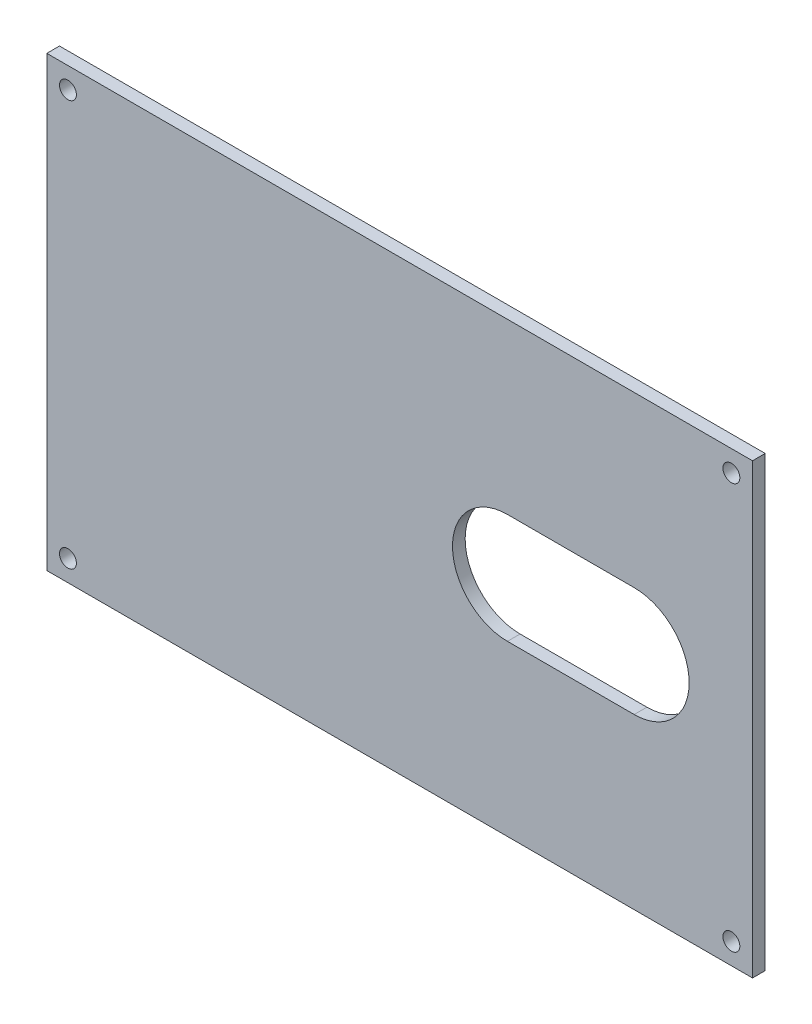
ISO-10303-21;
HEADER;
FILE_DESCRIPTION(('STEP AP214'),'2;1');
FILE_NAME('part.step','',(''),(''),'','','');
FILE_SCHEMA(('AUTOMOTIVE_DESIGN { 1 0 10303 214 1 1 1 1 }'));
ENDSEC;
DATA;
#1=APPLICATION_CONTEXT('core data for automotive mechanical design processes');
#2=APPLICATION_PROTOCOL_DEFINITION('international standard','automotive_design',2000,#1);
#3=PRODUCT_CONTEXT('',#1,'mechanical');
#4=PRODUCT('Part','Part','',(#3));
#5=PRODUCT_RELATED_PRODUCT_CATEGORY('part','',(#4));
#6=PRODUCT_DEFINITION_FORMATION('','',#4);
#7=PRODUCT_DEFINITION_CONTEXT('part definition',#1,'design');
#8=PRODUCT_DEFINITION('design','',#6,#7);
#9=PRODUCT_DEFINITION_SHAPE('','',#8);
#10=(LENGTH_UNIT() NAMED_UNIT(*) SI_UNIT(.MILLI.,.METRE.));
#11=(NAMED_UNIT(*) PLANE_ANGLE_UNIT() SI_UNIT($,.RADIAN.));
#12=(NAMED_UNIT(*) SI_UNIT($,.STERADIAN.) SOLID_ANGLE_UNIT());
#13=UNCERTAINTY_MEASURE_WITH_UNIT(LENGTH_MEASURE(1.E-05),#10,'distance_accuracy_value','');
#14=(GEOMETRIC_REPRESENTATION_CONTEXT(3) GLOBAL_UNCERTAINTY_ASSIGNED_CONTEXT((#13)) GLOBAL_UNIT_ASSIGNED_CONTEXT((#10,
#11,#12)) REPRESENTATION_CONTEXT('',''));
#15=CARTESIAN_POINT('',(0.,0.,0.));
#16=DIRECTION('',(0.,0.,1.));
#17=DIRECTION('',(1.,0.,0.));
#18=AXIS2_PLACEMENT_3D('',#15,#16,#17);
#19=CARTESIAN_POINT('',(0.,0.,3.));
#20=DIRECTION('',(0.,0.,1.));
#21=DIRECTION('',(1.,0.,0.));
#22=AXIS2_PLACEMENT_3D('',#19,#20,#21);
#23=PLANE('',#22);
#24=CARTESIAN_POINT('',(2.00000000000006,-2.,3.));
#25=DIRECTION('',(0.,0.,1.));
#26=DIRECTION('',(1.,0.,0.));
#27=AXIS2_PLACEMENT_3D('',#24,#25,#26);
#28=CIRCLE('',#27,2.);
#29=CARTESIAN_POINT('',(4.00000000000006,-2.,3.));
#30=VERTEX_POINT('',#29);
#31=EDGE_CURVE('E139',#30,#30,#28,.T.);
#32=ORIENTED_EDGE('',*,*,#31,.F.);
#33=EDGE_LOOP('',(#32));
#34=FACE_BOUND('',#33,.T.);
#35=CARTESIAN_POINT('',(159.,-98.,3.));
#36=DIRECTION('',(0.,0.,1.));
#37=DIRECTION('',(1.,0.,0.));
#38=AXIS2_PLACEMENT_3D('',#35,#36,#37);
#39=CIRCLE('',#38,2.);
#40=CARTESIAN_POINT('',(161.,-98.,3.));
#41=VERTEX_POINT('',#40);
#42=EDGE_CURVE('E151',#41,#41,#39,.T.);
#43=ORIENTED_EDGE('',*,*,#42,.F.);
#44=EDGE_LOOP('',(#43));
#45=FACE_BOUND('',#44,.T.);
#46=DIRECTION('',(0.,1.,0.));
#47=VECTOR('',#46,1.);
#48=CARTESIAN_POINT('',(164.,-103.,3.));
#49=LINE('',#48,#47);
#50=CARTESIAN_POINT('',(164.,-103.,3.));
#51=VERTEX_POINT('',#50);
#52=CARTESIAN_POINT('',(164.,3.,3.));
#53=VERTEX_POINT('',#52);
#54=EDGE_CURVE('E157',#51,#53,#49,.T.);
#55=ORIENTED_EDGE('',*,*,#54,.T.);
#56=DIRECTION('',(-1.,0.,0.));
#57=VECTOR('',#56,1.);
#58=CARTESIAN_POINT('',(164.,3.,3.));
#59=LINE('',#58,#57);
#60=CARTESIAN_POINT('',(-3.,3.,3.));
#61=VERTEX_POINT('',#60);
#62=EDGE_CURVE('E160',#53,#61,#59,.T.);
#63=ORIENTED_EDGE('',*,*,#62,.T.);
#64=DIRECTION('',(0.,-1.,0.));
#65=VECTOR('',#64,1.);
#66=CARTESIAN_POINT('',(-3.,3.,3.));
#67=LINE('',#66,#65);
#68=CARTESIAN_POINT('',(-3.,-103.,3.));
#69=VERTEX_POINT('',#68);
#70=EDGE_CURVE('E163',#61,#69,#67,.T.);
#71=ORIENTED_EDGE('',*,*,#70,.T.);
#72=DIRECTION('',(1.,0.,0.));
#73=VECTOR('',#72,1.);
#74=CARTESIAN_POINT('',(-3.,-103.,3.));
#75=LINE('',#74,#73);
#76=EDGE_CURVE('E165',#69,#51,#75,.T.);
#77=ORIENTED_EDGE('',*,*,#76,.T.);
#78=EDGE_LOOP('',(#55,#63,#71,#77));
#79=FACE_BOUND('',#78,.T.);
#80=CARTESIAN_POINT('',(2.00000000000006,-98.,3.));
#81=DIRECTION('',(0.,0.,1.));
#82=DIRECTION('',(1.,0.,0.));
#83=AXIS2_PLACEMENT_3D('',#80,#81,#82);
#84=CIRCLE('',#83,2.);
#85=CARTESIAN_POINT('',(4.00000000000006,-98.,3.));
#86=VERTEX_POINT('',#85);
#87=EDGE_CURVE('E145',#86,#86,#84,.T.);
#88=ORIENTED_EDGE('',*,*,#87,.F.);
#89=EDGE_LOOP('',(#88));
#90=FACE_BOUND('',#89,.T.);
#91=CARTESIAN_POINT('',(159.,-2.,3.));
#92=DIRECTION('',(0.,0.,1.));
#93=DIRECTION('',(1.,0.,0.));
#94=AXIS2_PLACEMENT_3D('',#91,#92,#93);
#95=CIRCLE('',#94,2.);
#96=CARTESIAN_POINT('',(161.,-2.,3.));
#97=VERTEX_POINT('',#96);
#98=EDGE_CURVE('E133',#97,#97,#95,.T.);
#99=ORIENTED_EDGE('',*,*,#98,.F.);
#100=EDGE_LOOP('',(#99));
#101=FACE_BOUND('',#100,.T.);
#102=DIRECTION('',(-1.,0.,0.));
#103=VECTOR('',#102,1.);
#104=CARTESIAN_POINT('',(106.,-37.,3.));
#105=LINE('',#104,#103);
#106=CARTESIAN_POINT('',(136.,-37.,3.));
#107=VERTEX_POINT('',#106);
#108=CARTESIAN_POINT('',(106.,-37.,3.));
#109=VERTEX_POINT('',#108);
#110=EDGE_CURVE('E105',#107,#109,#105,.T.);
#111=ORIENTED_EDGE('',*,*,#110,.F.);
#112=CARTESIAN_POINT('',(136.,-50.,3.));
#113=DIRECTION('',(0.,0.,1.));
#114=DIRECTION('',(1.,0.,0.));
#115=AXIS2_PLACEMENT_3D('',#112,#113,#114);
#116=CIRCLE('',#115,13.);
#117=CARTESIAN_POINT('',(136.,-63.,3.));
#118=VERTEX_POINT('',#117);
#119=EDGE_CURVE('E97',#118,#107,#116,.T.);
#120=ORIENTED_EDGE('',*,*,#119,.F.);
#121=DIRECTION('',(1.,0.,0.));
#122=VECTOR('',#121,1.);
#123=CARTESIAN_POINT('',(136.,-63.,3.));
#124=LINE('',#123,#122);
#125=CARTESIAN_POINT('',(106.,-63.,3.));
#126=VERTEX_POINT('',#125);
#127=EDGE_CURVE('E119',#126,#118,#124,.T.);
#128=ORIENTED_EDGE('',*,*,#127,.F.);
#129=CARTESIAN_POINT('',(106.,-50.,3.));
#130=DIRECTION('',(0.,0.,1.));
#131=DIRECTION('',(1.,0.,0.));
#132=AXIS2_PLACEMENT_3D('',#129,#130,#131);
#133=CIRCLE('',#132,13.);
#134=EDGE_CURVE('E117',#109,#126,#133,.T.);
#135=ORIENTED_EDGE('',*,*,#134,.F.);
#136=EDGE_LOOP('',(#111,#120,#128,#135));
#137=FACE_BOUND('',#136,.T.);
#138=ADVANCED_FACE('F32',(#34,#45,#79,#90,#101,#137),#23,.T.);
#139=CARTESIAN_POINT('',(0.,0.,0.));
#140=DIRECTION('',(0.,0.,1.));
#141=DIRECTION('',(1.,0.,0.));
#142=AXIS2_PLACEMENT_3D('',#139,#140,#141);
#143=PLANE('',#142);
#144=CARTESIAN_POINT('',(159.,-2.,0.));
#145=DIRECTION('',(0.,0.,1.));
#146=DIRECTION('',(1.,0.,0.));
#147=AXIS2_PLACEMENT_3D('',#144,#145,#146);
#148=CIRCLE('',#147,2.);
#149=CARTESIAN_POINT('',(161.,-2.,0.));
#150=VERTEX_POINT('',#149);
#151=EDGE_CURVE('E113',#150,#150,#148,.T.);
#152=ORIENTED_EDGE('',*,*,#151,.T.);
#153=EDGE_LOOP('',(#152));
#154=FACE_BOUND('',#153,.T.);
#155=CARTESIAN_POINT('',(2.00000000000006,-2.,0.));
#156=DIRECTION('',(0.,0.,1.));
#157=DIRECTION('',(1.,0.,0.));
#158=AXIS2_PLACEMENT_3D('',#155,#156,#157);
#159=CIRCLE('',#158,2.);
#160=CARTESIAN_POINT('',(4.00000000000006,-2.,0.));
#161=VERTEX_POINT('',#160);
#162=EDGE_CURVE('E136',#161,#161,#159,.T.);
#163=ORIENTED_EDGE('',*,*,#162,.T.);
#164=EDGE_LOOP('',(#163));
#165=FACE_BOUND('',#164,.T.);
#166=CARTESIAN_POINT('',(2.00000000000006,-98.,0.));
#167=DIRECTION('',(0.,0.,1.));
#168=DIRECTION('',(1.,0.,0.));
#169=AXIS2_PLACEMENT_3D('',#166,#167,#168);
#170=CIRCLE('',#169,2.);
#171=CARTESIAN_POINT('',(4.00000000000006,-98.,0.));
#172=VERTEX_POINT('',#171);
#173=EDGE_CURVE('E142',#172,#172,#170,.T.);
#174=ORIENTED_EDGE('',*,*,#173,.T.);
#175=EDGE_LOOP('',(#174));
#176=FACE_BOUND('',#175,.T.);
#177=CARTESIAN_POINT('',(159.,-98.,0.));
#178=DIRECTION('',(0.,0.,1.));
#179=DIRECTION('',(1.,0.,0.));
#180=AXIS2_PLACEMENT_3D('',#177,#178,#179);
#181=CIRCLE('',#180,2.);
#182=CARTESIAN_POINT('',(161.,-98.,0.));
#183=VERTEX_POINT('',#182);
#184=EDGE_CURVE('E148',#183,#183,#181,.T.);
#185=ORIENTED_EDGE('',*,*,#184,.T.);
#186=EDGE_LOOP('',(#185));
#187=FACE_BOUND('',#186,.T.);
#188=DIRECTION('',(0.,1.,0.));
#189=VECTOR('',#188,1.);
#190=CARTESIAN_POINT('',(164.,-103.,0.));
#191=LINE('',#190,#189);
#192=CARTESIAN_POINT('',(164.,-103.,0.));
#193=VERTEX_POINT('',#192);
#194=CARTESIAN_POINT('',(164.,3.,0.));
#195=VERTEX_POINT('',#194);
#196=EDGE_CURVE('E154',#193,#195,#191,.T.);
#197=ORIENTED_EDGE('',*,*,#196,.F.);
#198=DIRECTION('',(1.,0.,0.));
#199=VECTOR('',#198,1.);
#200=CARTESIAN_POINT('',(-3.,-103.,0.));
#201=LINE('',#200,#199);
#202=CARTESIAN_POINT('',(-3.,-103.,0.));
#203=VERTEX_POINT('',#202);
#204=EDGE_CURVE('E161',#203,#193,#201,.T.);
#205=ORIENTED_EDGE('',*,*,#204,.F.);
#206=DIRECTION('',(0.,-1.,0.));
#207=VECTOR('',#206,1.);
#208=CARTESIAN_POINT('',(-3.,3.,0.));
#209=LINE('',#208,#207);
#210=CARTESIAN_POINT('',(-3.,3.,0.));
#211=VERTEX_POINT('',#210);
#212=EDGE_CURVE('E172',#211,#203,#209,.T.);
#213=ORIENTED_EDGE('',*,*,#212,.F.);
#214=DIRECTION('',(-1.,0.,0.));
#215=VECTOR('',#214,1.);
#216=CARTESIAN_POINT('',(164.,3.,0.));
#217=LINE('',#216,#215);
#218=EDGE_CURVE('E170',#195,#211,#217,.T.);
#219=ORIENTED_EDGE('',*,*,#218,.F.);
#220=EDGE_LOOP('',(#197,#205,#213,#219));
#221=FACE_BOUND('',#220,.T.);
#222=CARTESIAN_POINT('',(136.,-50.,0.));
#223=DIRECTION('',(0.,0.,1.));
#224=DIRECTION('',(1.,0.,0.));
#225=AXIS2_PLACEMENT_3D('',#222,#223,#224);
#226=CIRCLE('',#225,13.);
#227=CARTESIAN_POINT('',(136.,-63.,0.));
#228=VERTEX_POINT('',#227);
#229=CARTESIAN_POINT('',(136.,-37.,0.));
#230=VERTEX_POINT('',#229);
#231=EDGE_CURVE('E55',#228,#230,#226,.T.);
#232=ORIENTED_EDGE('',*,*,#231,.T.);
#233=DIRECTION('',(-1.,0.,0.));
#234=VECTOR('',#233,1.);
#235=CARTESIAN_POINT('',(106.,-37.,0.));
#236=LINE('',#235,#234);
#237=CARTESIAN_POINT('',(106.,-37.,0.));
#238=VERTEX_POINT('',#237);
#239=EDGE_CURVE('E112',#230,#238,#236,.T.);
#240=ORIENTED_EDGE('',*,*,#239,.T.);
#241=CARTESIAN_POINT('',(106.,-50.,0.));
#242=DIRECTION('',(0.,0.,1.));
#243=DIRECTION('',(1.,0.,0.));
#244=AXIS2_PLACEMENT_3D('',#241,#242,#243);
#245=CIRCLE('',#244,13.);
#246=CARTESIAN_POINT('',(106.,-63.,0.));
#247=VERTEX_POINT('',#246);
#248=EDGE_CURVE('E125',#238,#247,#245,.T.);
#249=ORIENTED_EDGE('',*,*,#248,.T.);
#250=DIRECTION('',(1.,0.,0.));
#251=VECTOR('',#250,1.);
#252=CARTESIAN_POINT('',(136.,-63.,0.));
#253=LINE('',#252,#251);
#254=EDGE_CURVE('E106',#247,#228,#253,.T.);
#255=ORIENTED_EDGE('',*,*,#254,.T.);
#256=EDGE_LOOP('',(#232,#240,#249,#255));
#257=FACE_BOUND('',#256,.T.);
#258=ADVANCED_FACE('F190',(#154,#165,#176,#187,#221,#257),#143,.F.);
#259=CARTESIAN_POINT('',(164.,-103.,3.));
#260=DIRECTION('',(-1.,0.,0.));
#261=DIRECTION('',(0.,0.,1.));
#262=AXIS2_PLACEMENT_3D('',#259,#260,#261);
#263=PLANE('',#262);
#264=ORIENTED_EDGE('',*,*,#196,.T.);
#265=DIRECTION('',(0.,0.,-1.));
#266=VECTOR('',#265,1.);
#267=CARTESIAN_POINT('',(164.,3.,3.));
#268=LINE('',#267,#266);
#269=EDGE_CURVE('E11',#53,#195,#268,.T.);
#270=ORIENTED_EDGE('',*,*,#269,.F.);
#271=ORIENTED_EDGE('',*,*,#54,.F.);
#272=DIRECTION('',(0.,0.,-1.));
#273=VECTOR('',#272,1.);
#274=CARTESIAN_POINT('',(164.,-103.,3.));
#275=LINE('',#274,#273);
#276=EDGE_CURVE('E167',#51,#193,#275,.T.);
#277=ORIENTED_EDGE('',*,*,#276,.T.);
#278=EDGE_LOOP('',(#264,#270,#271,#277));
#279=FACE_BOUND('',#278,.T.);
#280=ADVANCED_FACE('F34',(#279),#263,.F.);
#281=CARTESIAN_POINT('',(164.,3.,3.));
#282=DIRECTION('',(0.,-1.,0.));
#283=DIRECTION('',(0.,0.,-1.));
#284=AXIS2_PLACEMENT_3D('',#281,#282,#283);
#285=PLANE('',#284);
#286=ORIENTED_EDGE('',*,*,#218,.T.);
#287=DIRECTION('',(0.,0.,-1.));
#288=VECTOR('',#287,1.);
#289=CARTESIAN_POINT('',(-3.,3.,3.));
#290=LINE('',#289,#288);
#291=EDGE_CURVE('E40',#61,#211,#290,.T.);
#292=ORIENTED_EDGE('',*,*,#291,.F.);
#293=ORIENTED_EDGE('',*,*,#62,.F.);
#294=ORIENTED_EDGE('',*,*,#269,.T.);
#295=EDGE_LOOP('',(#286,#292,#293,#294));
#296=FACE_BOUND('',#295,.T.);
#297=ADVANCED_FACE('F201',(#296),#285,.F.);
#298=CARTESIAN_POINT('',(-3.,3.,3.));
#299=DIRECTION('',(1.,0.,0.));
#300=DIRECTION('',(0.,0.,-1.));
#301=AXIS2_PLACEMENT_3D('',#298,#299,#300);
#302=PLANE('',#301);
#303=ORIENTED_EDGE('',*,*,#212,.T.);
#304=DIRECTION('',(0.,0.,-1.));
#305=VECTOR('',#304,1.);
#306=CARTESIAN_POINT('',(-3.,-103.,3.));
#307=LINE('',#306,#305);
#308=EDGE_CURVE('E177',#69,#203,#307,.T.);
#309=ORIENTED_EDGE('',*,*,#308,.F.);
#310=ORIENTED_EDGE('',*,*,#70,.F.);
#311=ORIENTED_EDGE('',*,*,#291,.T.);
#312=EDGE_LOOP('',(#303,#309,#310,#311));
#313=FACE_BOUND('',#312,.T.);
#314=ADVANCED_FACE('F184',(#313),#302,.F.);
#315=CARTESIAN_POINT('',(-3.,-103.,3.));
#316=DIRECTION('',(0.,1.,0.));
#317=DIRECTION('',(0.,0.,1.));
#318=AXIS2_PLACEMENT_3D('',#315,#316,#317);
#319=PLANE('',#318);
#320=ORIENTED_EDGE('',*,*,#204,.T.);
#321=ORIENTED_EDGE('',*,*,#276,.F.);
#322=ORIENTED_EDGE('',*,*,#76,.F.);
#323=ORIENTED_EDGE('',*,*,#308,.T.);
#324=EDGE_LOOP('',(#320,#321,#322,#323));
#325=FACE_BOUND('',#324,.T.);
#326=ADVANCED_FACE('F194',(#325),#319,.F.);
#327=CARTESIAN_POINT('',(159.,-98.,3.));
#328=DIRECTION('',(0.,0.,-1.));
#329=DIRECTION('',(-1.,0.,0.));
#330=AXIS2_PLACEMENT_3D('',#327,#328,#329);
#331=CYLINDRICAL_SURFACE('',#330,2.);
#332=ORIENTED_EDGE('',*,*,#42,.T.);
#333=EDGE_LOOP('',(#332));
#334=FACE_BOUND('',#333,.T.);
#335=ORIENTED_EDGE('',*,*,#184,.F.);
#336=EDGE_LOOP('',(#335));
#337=FACE_BOUND('',#336,.T.);
#338=ADVANCED_FACE('F219',(#334,#337),#331,.F.);
#339=CARTESIAN_POINT('',(2.00000000000006,-98.,3.));
#340=DIRECTION('',(0.,0.,-1.));
#341=DIRECTION('',(-1.,0.,0.));
#342=AXIS2_PLACEMENT_3D('',#339,#340,#341);
#343=CYLINDRICAL_SURFACE('',#342,2.);
#344=ORIENTED_EDGE('',*,*,#87,.T.);
#345=EDGE_LOOP('',(#344));
#346=FACE_BOUND('',#345,.T.);
#347=ORIENTED_EDGE('',*,*,#173,.F.);
#348=EDGE_LOOP('',(#347));
#349=FACE_BOUND('',#348,.T.);
#350=ADVANCED_FACE('F226',(#346,#349),#343,.F.);
#351=CARTESIAN_POINT('',(2.00000000000006,-2.,3.));
#352=DIRECTION('',(0.,0.,-1.));
#353=DIRECTION('',(-1.,0.,0.));
#354=AXIS2_PLACEMENT_3D('',#351,#352,#353);
#355=CYLINDRICAL_SURFACE('',#354,2.);
#356=ORIENTED_EDGE('',*,*,#31,.T.);
#357=EDGE_LOOP('',(#356));
#358=FACE_BOUND('',#357,.T.);
#359=ORIENTED_EDGE('',*,*,#162,.F.);
#360=EDGE_LOOP('',(#359));
#361=FACE_BOUND('',#360,.T.);
#362=ADVANCED_FACE('F231',(#358,#361),#355,.F.);
#363=CARTESIAN_POINT('',(159.,-2.,3.));
#364=DIRECTION('',(0.,0.,-1.));
#365=DIRECTION('',(-1.,0.,0.));
#366=AXIS2_PLACEMENT_3D('',#363,#364,#365);
#367=CYLINDRICAL_SURFACE('',#366,2.);
#368=ORIENTED_EDGE('',*,*,#98,.T.);
#369=EDGE_LOOP('',(#368));
#370=FACE_BOUND('',#369,.T.);
#371=ORIENTED_EDGE('',*,*,#151,.F.);
#372=EDGE_LOOP('',(#371));
#373=FACE_BOUND('',#372,.T.);
#374=ADVANCED_FACE('F240',(#370,#373),#367,.F.);
#375=CARTESIAN_POINT('',(136.,-50.,3.));
#376=DIRECTION('',(0.,0.,-1.));
#377=DIRECTION('',(-1.,0.,0.));
#378=AXIS2_PLACEMENT_3D('',#375,#376,#377);
#379=CYLINDRICAL_SURFACE('',#378,13.);
#380=ORIENTED_EDGE('',*,*,#231,.F.);
#381=DIRECTION('',(0.,0.,-1.));
#382=VECTOR('',#381,1.);
#383=CARTESIAN_POINT('',(136.,-63.,3.));
#384=LINE('',#383,#382);
#385=EDGE_CURVE('E101',#118,#228,#384,.T.);
#386=ORIENTED_EDGE('',*,*,#385,.F.);
#387=ORIENTED_EDGE('',*,*,#119,.T.);
#388=DIRECTION('',(0.,0.,-1.));
#389=VECTOR('',#388,1.);
#390=CARTESIAN_POINT('',(136.,-37.,3.));
#391=LINE('',#390,#389);
#392=EDGE_CURVE('E100',#107,#230,#391,.T.);
#393=ORIENTED_EDGE('',*,*,#392,.T.);
#394=EDGE_LOOP('',(#380,#386,#387,#393));
#395=FACE_BOUND('',#394,.T.);
#396=ADVANCED_FACE('F99',(#395),#379,.F.);
#397=CARTESIAN_POINT('',(106.,-37.,3.));
#398=DIRECTION('',(0.,-1.,0.));
#399=DIRECTION('',(0.,0.,-1.));
#400=AXIS2_PLACEMENT_3D('',#397,#398,#399);
#401=PLANE('',#400);
#402=ORIENTED_EDGE('',*,*,#239,.F.);
#403=ORIENTED_EDGE('',*,*,#392,.F.);
#404=ORIENTED_EDGE('',*,*,#110,.T.);
#405=DIRECTION('',(0.,0.,-1.));
#406=VECTOR('',#405,1.);
#407=CARTESIAN_POINT('',(106.,-37.,3.));
#408=LINE('',#407,#406);
#409=EDGE_CURVE('E114',#109,#238,#408,.T.);
#410=ORIENTED_EDGE('',*,*,#409,.T.);
#411=EDGE_LOOP('',(#402,#403,#404,#410));
#412=FACE_BOUND('',#411,.T.);
#413=ADVANCED_FACE('F109',(#412),#401,.T.);
#414=CARTESIAN_POINT('',(106.,-50.,3.));
#415=DIRECTION('',(0.,0.,-1.));
#416=DIRECTION('',(-1.,0.,0.));
#417=AXIS2_PLACEMENT_3D('',#414,#415,#416);
#418=CYLINDRICAL_SURFACE('',#417,13.);
#419=ORIENTED_EDGE('',*,*,#248,.F.);
#420=ORIENTED_EDGE('',*,*,#409,.F.);
#421=ORIENTED_EDGE('',*,*,#134,.T.);
#422=DIRECTION('',(0.,0.,-1.));
#423=VECTOR('',#422,1.);
#424=CARTESIAN_POINT('',(106.,-63.,3.));
#425=LINE('',#424,#423);
#426=EDGE_CURVE('E47',#126,#247,#425,.T.);
#427=ORIENTED_EDGE('',*,*,#426,.T.);
#428=EDGE_LOOP('',(#419,#420,#421,#427));
#429=FACE_BOUND('',#428,.T.);
#430=ADVANCED_FACE('F252',(#429),#418,.F.);
#431=CARTESIAN_POINT('',(136.,-63.,3.));
#432=DIRECTION('',(0.,1.,0.));
#433=DIRECTION('',(0.,0.,1.));
#434=AXIS2_PLACEMENT_3D('',#431,#432,#433);
#435=PLANE('',#434);
#436=ORIENTED_EDGE('',*,*,#254,.F.);
#437=ORIENTED_EDGE('',*,*,#426,.F.);
#438=ORIENTED_EDGE('',*,*,#127,.T.);
#439=ORIENTED_EDGE('',*,*,#385,.T.);
#440=EDGE_LOOP('',(#436,#437,#438,#439));
#441=FACE_BOUND('',#440,.T.);
#442=ADVANCED_FACE('F255',(#441),#435,.T.);
#443=CLOSED_SHELL('',(#138,#258,#280,#297,#314,#326,#338,#350,#362,#374,#396,#413,#430,#442));
#444=MANIFOLD_SOLID_BREP('B2',#443);
#445=ADVANCED_BREP_SHAPE_REPRESENTATION('',(#18,#444),#14);
#446=SHAPE_DEFINITION_REPRESENTATION(#9,#445);
ENDSEC;
END-ISO-10303-21;
